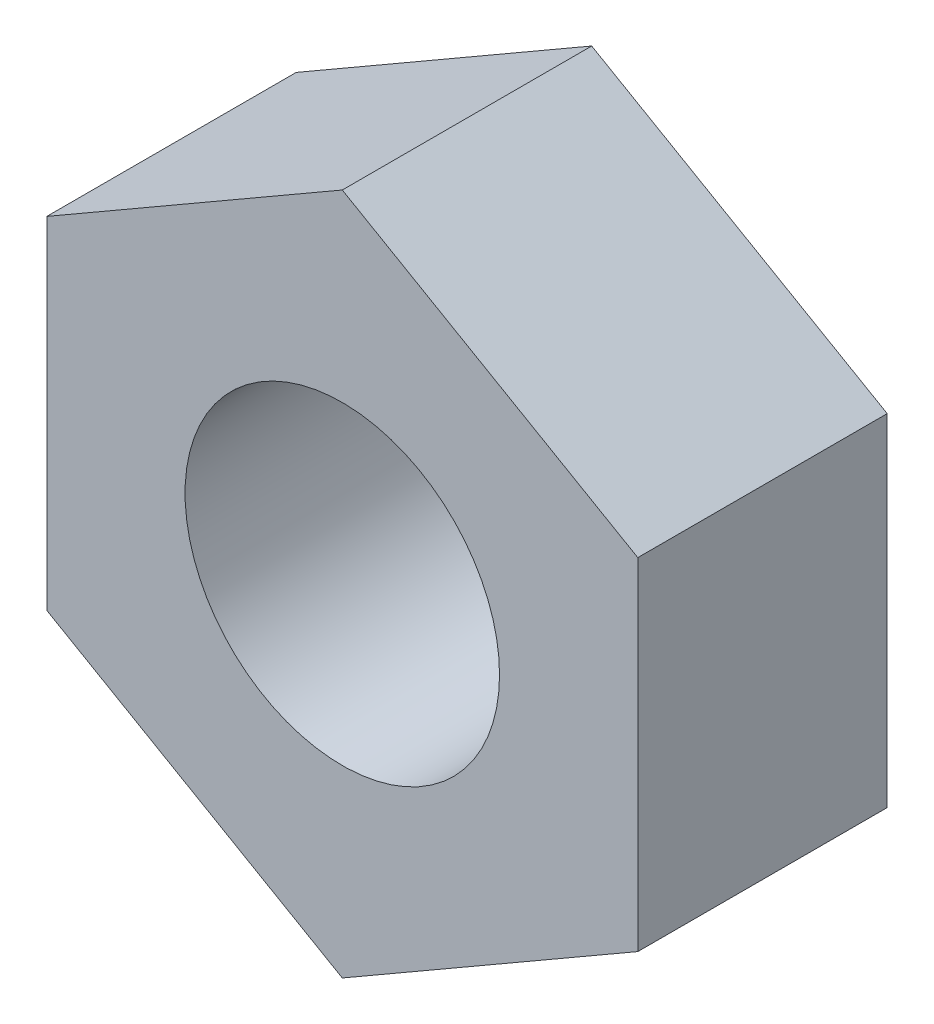
ISO-10303-21;
HEADER;
FILE_DESCRIPTION(('STEP AP214'),'2;1');
FILE_NAME('part.step','',(''),(''),'','','');
FILE_SCHEMA(('AUTOMOTIVE_DESIGN { 1 0 10303 214 1 1 1 1 }'));
ENDSEC;
DATA;
#1=APPLICATION_CONTEXT('core data for automotive mechanical design processes');
#2=APPLICATION_PROTOCOL_DEFINITION('international standard','automotive_design',2000,#1);
#3=PRODUCT_CONTEXT('',#1,'mechanical');
#4=PRODUCT('Part','Part','',(#3));
#5=PRODUCT_RELATED_PRODUCT_CATEGORY('part','',(#4));
#6=PRODUCT_DEFINITION_FORMATION('','',#4);
#7=PRODUCT_DEFINITION_CONTEXT('part definition',#1,'design');
#8=PRODUCT_DEFINITION('design','',#6,#7);
#9=PRODUCT_DEFINITION_SHAPE('','',#8);
#10=(LENGTH_UNIT() NAMED_UNIT(*) SI_UNIT(.MILLI.,.METRE.));
#11=(NAMED_UNIT(*) PLANE_ANGLE_UNIT() SI_UNIT($,.RADIAN.));
#12=(NAMED_UNIT(*) SI_UNIT($,.STERADIAN.) SOLID_ANGLE_UNIT());
#13=UNCERTAINTY_MEASURE_WITH_UNIT(LENGTH_MEASURE(1.E-05),#10,'distance_accuracy_value','');
#14=(GEOMETRIC_REPRESENTATION_CONTEXT(3) GLOBAL_UNCERTAINTY_ASSIGNED_CONTEXT((#13)) GLOBAL_UNIT_ASSIGNED_CONTEXT((#10,
#11,#12)) REPRESENTATION_CONTEXT('',''));
#15=CARTESIAN_POINT('',(0.,0.,0.));
#16=DIRECTION('',(0.,0.,1.));
#17=DIRECTION('',(1.,0.,0.));
#18=AXIS2_PLACEMENT_3D('',#15,#16,#17);
#19=CARTESIAN_POINT('',(-2.725,4.71983845062519,2.3));
#20=DIRECTION('',(0.,0.,1.));
#21=DIRECTION('',(1.,0.,0.));
#22=AXIS2_PLACEMENT_3D('',#19,#20,#21);
#23=PLANE('',#22);
#24=DIRECTION('',(-0.866025403784439,0.5,0.));
#25=VECTOR('',#24,1.);
#26=CARTESIAN_POINT('',(2.725,1.57327948354173,2.3));
#27=LINE('',#26,#25);
#28=CARTESIAN_POINT('',(2.725,1.57327948354173,2.3));
#29=VERTEX_POINT('',#28);
#30=CARTESIAN_POINT('',(0.,3.14655896708346,2.3));
#31=VERTEX_POINT('',#30);
#32=EDGE_CURVE('E114',#29,#31,#27,.T.);
#33=ORIENTED_EDGE('',*,*,#32,.T.);
#34=DIRECTION('',(-0.866025403784439,-0.5,0.));
#35=VECTOR('',#34,1.);
#36=CARTESIAN_POINT('',(0.,3.14655896708346,2.3));
#37=LINE('',#36,#35);
#38=CARTESIAN_POINT('',(-2.725,1.57327948354173,2.3));
#39=VERTEX_POINT('',#38);
#40=EDGE_CURVE('E95',#31,#39,#37,.T.);
#41=ORIENTED_EDGE('',*,*,#40,.T.);
#42=DIRECTION('',(0.,-1.,0.));
#43=VECTOR('',#42,1.);
#44=CARTESIAN_POINT('',(-2.725,1.57327948354173,2.3));
#45=LINE('',#44,#43);
#46=CARTESIAN_POINT('',(-2.725,-1.57327948354173,2.3));
#47=VERTEX_POINT('',#46);
#48=EDGE_CURVE('E117',#39,#47,#45,.T.);
#49=ORIENTED_EDGE('',*,*,#48,.T.);
#50=DIRECTION('',(0.866025403784439,-0.5,0.));
#51=VECTOR('',#50,1.);
#52=CARTESIAN_POINT('',(-2.725,-1.57327948354173,2.3));
#53=LINE('',#52,#51);
#54=CARTESIAN_POINT('',(0.,-3.14655896708346,2.3));
#55=VERTEX_POINT('',#54);
#56=EDGE_CURVE('E119',#47,#55,#53,.T.);
#57=ORIENTED_EDGE('',*,*,#56,.T.);
#58=DIRECTION('',(0.866025403784439,0.5,0.));
#59=VECTOR('',#58,1.);
#60=CARTESIAN_POINT('',(0.,-3.14655896708346,2.3));
#61=LINE('',#60,#59);
#62=CARTESIAN_POINT('',(2.725,-1.57327948354173,2.3));
#63=VERTEX_POINT('',#62);
#64=EDGE_CURVE('E48',#55,#63,#61,.T.);
#65=ORIENTED_EDGE('',*,*,#64,.T.);
#66=DIRECTION('',(0.,1.,0.));
#67=VECTOR('',#66,1.);
#68=CARTESIAN_POINT('',(2.725,-1.57327948354173,2.3));
#69=LINE('',#68,#67);
#70=EDGE_CURVE('E43',#63,#29,#69,.T.);
#71=ORIENTED_EDGE('',*,*,#70,.T.);
#72=EDGE_LOOP('',(#33,#41,#49,#57,#65,#71));
#73=FACE_BOUND('',#72,.T.);
#74=CARTESIAN_POINT('',(0.,0.,2.3));
#75=DIRECTION('',(0.,0.,1.));
#76=DIRECTION('',(1.,0.,0.));
#77=AXIS2_PLACEMENT_3D('',#74,#75,#76);
#78=CIRCLE('',#77,1.45);
#79=CARTESIAN_POINT('',(1.45,0.,2.3));
#80=VERTEX_POINT('',#79);
#81=EDGE_CURVE('E100',#80,#80,#78,.T.);
#82=ORIENTED_EDGE('',*,*,#81,.F.);
#83=EDGE_LOOP('',(#82));
#84=FACE_BOUND('',#83,.T.);
#85=ADVANCED_FACE('F28',(#73,#84),#23,.T.);
#86=CARTESIAN_POINT('',(-2.725,4.71983845062519,0.));
#87=DIRECTION('',(0.,0.,1.));
#88=DIRECTION('',(1.,0.,0.));
#89=AXIS2_PLACEMENT_3D('',#86,#87,#88);
#90=PLANE('',#89);
#91=DIRECTION('',(-0.866025403784439,0.5,0.));
#92=VECTOR('',#91,1.);
#93=CARTESIAN_POINT('',(2.725,1.57327948354173,0.));
#94=LINE('',#93,#92);
#95=CARTESIAN_POINT('',(2.725,1.57327948354173,0.));
#96=VERTEX_POINT('',#95);
#97=CARTESIAN_POINT('',(0.,3.14655896708346,0.));
#98=VERTEX_POINT('',#97);
#99=EDGE_CURVE('E86',#96,#98,#94,.T.);
#100=ORIENTED_EDGE('',*,*,#99,.F.);
#101=DIRECTION('',(0.,1.,0.));
#102=VECTOR('',#101,1.);
#103=CARTESIAN_POINT('',(2.725,-1.57327948354173,0.));
#104=LINE('',#103,#102);
#105=CARTESIAN_POINT('',(2.725,-1.57327948354173,0.));
#106=VERTEX_POINT('',#105);
#107=EDGE_CURVE('E112',#106,#96,#104,.T.);
#108=ORIENTED_EDGE('',*,*,#107,.F.);
#109=DIRECTION('',(0.866025403784439,0.5,0.));
#110=VECTOR('',#109,1.);
#111=CARTESIAN_POINT('',(0.,-3.14655896708346,0.));
#112=LINE('',#111,#110);
#113=CARTESIAN_POINT('',(0.,-3.14655896708346,0.));
#114=VERTEX_POINT('',#113);
#115=EDGE_CURVE('E110',#114,#106,#112,.T.);
#116=ORIENTED_EDGE('',*,*,#115,.F.);
#117=DIRECTION('',(0.866025403784439,-0.5,0.));
#118=VECTOR('',#117,1.);
#119=CARTESIAN_POINT('',(-2.725,-1.57327948354173,0.));
#120=LINE('',#119,#118);
#121=CARTESIAN_POINT('',(-2.725,-1.57327948354173,0.));
#122=VERTEX_POINT('',#121);
#123=EDGE_CURVE('E108',#122,#114,#120,.T.);
#124=ORIENTED_EDGE('',*,*,#123,.F.);
#125=DIRECTION('',(0.,-1.,0.));
#126=VECTOR('',#125,1.);
#127=CARTESIAN_POINT('',(-2.725,1.57327948354173,0.));
#128=LINE('',#127,#126);
#129=CARTESIAN_POINT('',(-2.725,1.57327948354173,0.));
#130=VERTEX_POINT('',#129);
#131=EDGE_CURVE('E88',#130,#122,#128,.T.);
#132=ORIENTED_EDGE('',*,*,#131,.F.);
#133=DIRECTION('',(-0.866025403784439,-0.5,0.));
#134=VECTOR('',#133,1.);
#135=CARTESIAN_POINT('',(0.,3.14655896708346,0.));
#136=LINE('',#135,#134);
#137=EDGE_CURVE('E81',#98,#130,#136,.T.);
#138=ORIENTED_EDGE('',*,*,#137,.F.);
#139=EDGE_LOOP('',(#100,#108,#116,#124,#132,#138));
#140=FACE_BOUND('',#139,.T.);
#141=CARTESIAN_POINT('',(0.,0.,0.));
#142=DIRECTION('',(0.,0.,1.));
#143=DIRECTION('',(1.,0.,0.));
#144=AXIS2_PLACEMENT_3D('',#141,#142,#143);
#145=CIRCLE('',#144,1.45);
#146=CARTESIAN_POINT('',(1.45,0.,0.));
#147=VERTEX_POINT('',#146);
#148=EDGE_CURVE('E103',#147,#147,#145,.T.);
#149=ORIENTED_EDGE('',*,*,#148,.T.);
#150=EDGE_LOOP('',(#149));
#151=FACE_BOUND('',#150,.T.);
#152=ADVANCED_FACE('F82',(#140,#151),#90,.F.);
#153=CARTESIAN_POINT('',(2.725,1.57327948354173,2.3));
#154=DIRECTION('',(-0.5,-0.866025403784439,0.));
#155=DIRECTION('',(0.866025403784439,-0.5,0.));
#156=AXIS2_PLACEMENT_3D('',#153,#154,#155);
#157=PLANE('',#156);
#158=ORIENTED_EDGE('',*,*,#99,.T.);
#159=DIRECTION('',(0.,0.,-1.));
#160=VECTOR('',#159,1.);
#161=CARTESIAN_POINT('',(0.,3.14655896708346,2.3));
#162=LINE('',#161,#160);
#163=EDGE_CURVE('E11',#31,#98,#162,.T.);
#164=ORIENTED_EDGE('',*,*,#163,.F.);
#165=ORIENTED_EDGE('',*,*,#32,.F.);
#166=DIRECTION('',(0.,0.,-1.));
#167=VECTOR('',#166,1.);
#168=CARTESIAN_POINT('',(2.725,1.57327948354173,2.3));
#169=LINE('',#168,#167);
#170=EDGE_CURVE('E99',#29,#96,#169,.T.);
#171=ORIENTED_EDGE('',*,*,#170,.T.);
#172=EDGE_LOOP('',(#158,#164,#165,#171));
#173=FACE_BOUND('',#172,.T.);
#174=ADVANCED_FACE('F30',(#173),#157,.F.);
#175=CARTESIAN_POINT('',(0.,3.14655896708346,2.3));
#176=DIRECTION('',(0.5,-0.866025403784439,0.));
#177=DIRECTION('',(0.866025403784439,0.5,0.));
#178=AXIS2_PLACEMENT_3D('',#175,#176,#177);
#179=PLANE('',#178);
#180=ORIENTED_EDGE('',*,*,#137,.T.);
#181=DIRECTION('',(0.,0.,-1.));
#182=VECTOR('',#181,1.);
#183=CARTESIAN_POINT('',(-2.725,1.57327948354173,2.3));
#184=LINE('',#183,#182);
#185=EDGE_CURVE('E36',#39,#130,#184,.T.);
#186=ORIENTED_EDGE('',*,*,#185,.F.);
#187=ORIENTED_EDGE('',*,*,#40,.F.);
#188=ORIENTED_EDGE('',*,*,#163,.T.);
#189=EDGE_LOOP('',(#180,#186,#187,#188));
#190=FACE_BOUND('',#189,.T.);
#191=ADVANCED_FACE('F94',(#190),#179,.F.);
#192=CARTESIAN_POINT('',(-2.725,1.57327948354173,2.3));
#193=DIRECTION('',(1.,0.,0.));
#194=DIRECTION('',(0.,1.,0.));
#195=AXIS2_PLACEMENT_3D('',#192,#193,#194);
#196=PLANE('',#195);
#197=ORIENTED_EDGE('',*,*,#131,.T.);
#198=DIRECTION('',(0.,0.,-1.));
#199=VECTOR('',#198,1.);
#200=CARTESIAN_POINT('',(-2.725,-1.57327948354173,2.3));
#201=LINE('',#200,#199);
#202=EDGE_CURVE('E130',#47,#122,#201,.T.);
#203=ORIENTED_EDGE('',*,*,#202,.F.);
#204=ORIENTED_EDGE('',*,*,#48,.F.);
#205=ORIENTED_EDGE('',*,*,#185,.T.);
#206=EDGE_LOOP('',(#197,#203,#204,#205));
#207=FACE_BOUND('',#206,.T.);
#208=ADVANCED_FACE('F134',(#207),#196,.F.);
#209=CARTESIAN_POINT('',(-2.725,-1.57327948354173,2.3));
#210=DIRECTION('',(0.5,0.866025403784438,0.));
#211=DIRECTION('',(-0.866025403784439,0.5,0.));
#212=AXIS2_PLACEMENT_3D('',#209,#210,#211);
#213=PLANE('',#212);
#214=ORIENTED_EDGE('',*,*,#123,.T.);
#215=DIRECTION('',(0.,0.,-1.));
#216=VECTOR('',#215,1.);
#217=CARTESIAN_POINT('',(0.,-3.14655896708346,2.3));
#218=LINE('',#217,#216);
#219=EDGE_CURVE('E127',#55,#114,#218,.T.);
#220=ORIENTED_EDGE('',*,*,#219,.F.);
#221=ORIENTED_EDGE('',*,*,#56,.F.);
#222=ORIENTED_EDGE('',*,*,#202,.T.);
#223=EDGE_LOOP('',(#214,#220,#221,#222));
#224=FACE_BOUND('',#223,.T.);
#225=ADVANCED_FACE('F140',(#224),#213,.F.);
#226=CARTESIAN_POINT('',(0.,-3.14655896708346,2.3));
#227=DIRECTION('',(-0.5,0.866025403784439,0.));
#228=DIRECTION('',(-0.866025403784439,-0.5,0.));
#229=AXIS2_PLACEMENT_3D('',#226,#227,#228);
#230=PLANE('',#229);
#231=ORIENTED_EDGE('',*,*,#115,.T.);
#232=DIRECTION('',(0.,0.,-1.));
#233=VECTOR('',#232,1.);
#234=CARTESIAN_POINT('',(2.725,-1.57327948354173,2.3));
#235=LINE('',#234,#233);
#236=EDGE_CURVE('E124',#63,#106,#235,.T.);
#237=ORIENTED_EDGE('',*,*,#236,.F.);
#238=ORIENTED_EDGE('',*,*,#64,.F.);
#239=ORIENTED_EDGE('',*,*,#219,.T.);
#240=EDGE_LOOP('',(#231,#237,#238,#239));
#241=FACE_BOUND('',#240,.T.);
#242=ADVANCED_FACE('F143',(#241),#230,.F.);
#243=CARTESIAN_POINT('',(2.725,-1.57327948354173,2.3));
#244=DIRECTION('',(-1.,0.,0.));
#245=DIRECTION('',(0.,0.,1.));
#246=AXIS2_PLACEMENT_3D('',#243,#244,#245);
#247=PLANE('',#246);
#248=ORIENTED_EDGE('',*,*,#107,.T.);
#249=ORIENTED_EDGE('',*,*,#170,.F.);
#250=ORIENTED_EDGE('',*,*,#70,.F.);
#251=ORIENTED_EDGE('',*,*,#236,.T.);
#252=EDGE_LOOP('',(#248,#249,#250,#251));
#253=FACE_BOUND('',#252,.T.);
#254=ADVANCED_FACE('F145',(#253),#247,.F.);
#255=CARTESIAN_POINT('',(0.,0.,2.3));
#256=DIRECTION('',(0.,0.,-1.));
#257=DIRECTION('',(-1.,0.,0.));
#258=AXIS2_PLACEMENT_3D('',#255,#256,#257);
#259=CYLINDRICAL_SURFACE('',#258,1.45);
#260=ORIENTED_EDGE('',*,*,#81,.T.);
#261=EDGE_LOOP('',(#260));
#262=FACE_BOUND('',#261,.T.);
#263=ORIENTED_EDGE('',*,*,#148,.F.);
#264=EDGE_LOOP('',(#263));
#265=FACE_BOUND('',#264,.T.);
#266=ADVANCED_FACE('F147',(#262,#265),#259,.F.);
#267=CLOSED_SHELL('',(#85,#152,#174,#191,#208,#225,#242,#254,#266));
#268=MANIFOLD_SOLID_BREP('B2',#267);
#269=ADVANCED_BREP_SHAPE_REPRESENTATION('',(#18,#268),#14);
#270=SHAPE_DEFINITION_REPRESENTATION(#9,#269);
ENDSEC;
END-ISO-10303-21;
